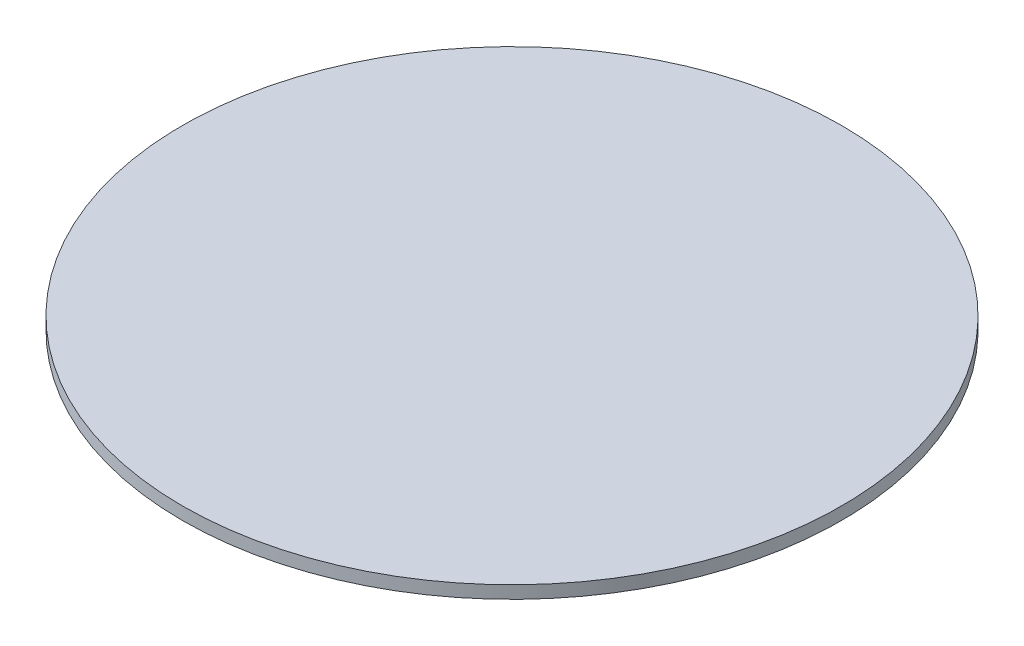
ISO-10303-21;
HEADER;
FILE_DESCRIPTION(('STEP AP214'),'2;1');
FILE_NAME('part.step','',(''),(''),'','','');
FILE_SCHEMA(('AUTOMOTIVE_DESIGN { 1 0 10303 214 1 1 1 1 }'));
ENDSEC;
DATA;
#1=APPLICATION_CONTEXT('core data for automotive mechanical design processes');
#2=APPLICATION_PROTOCOL_DEFINITION('international standard','automotive_design',2000,#1);
#3=PRODUCT_CONTEXT('',#1,'mechanical');
#4=PRODUCT('Part','Part','',(#3));
#5=PRODUCT_RELATED_PRODUCT_CATEGORY('part','',(#4));
#6=PRODUCT_DEFINITION_FORMATION('','',#4);
#7=PRODUCT_DEFINITION_CONTEXT('part definition',#1,'design');
#8=PRODUCT_DEFINITION('design','',#6,#7);
#9=PRODUCT_DEFINITION_SHAPE('','',#8);
#10=(LENGTH_UNIT() NAMED_UNIT(*) SI_UNIT(.MILLI.,.METRE.));
#11=(NAMED_UNIT(*) PLANE_ANGLE_UNIT() SI_UNIT($,.RADIAN.));
#12=(NAMED_UNIT(*) SI_UNIT($,.STERADIAN.) SOLID_ANGLE_UNIT());
#13=UNCERTAINTY_MEASURE_WITH_UNIT(LENGTH_MEASURE(1.E-05),#10,'distance_accuracy_value','');
#14=(GEOMETRIC_REPRESENTATION_CONTEXT(3) GLOBAL_UNCERTAINTY_ASSIGNED_CONTEXT((#13)) GLOBAL_UNIT_ASSIGNED_CONTEXT((#10,
#11,#12)) REPRESENTATION_CONTEXT('',''));
#15=CARTESIAN_POINT('',(0.,0.,0.));
#16=DIRECTION('',(0.,0.,1.));
#17=DIRECTION('',(1.,0.,0.));
#18=AXIS2_PLACEMENT_3D('',#15,#16,#17);
#19=CARTESIAN_POINT('',(0.,3.048,0.));
#20=DIRECTION('',(0.,-1.,0.));
#21=DIRECTION('',(0.,0.,-1.));
#22=AXIS2_PLACEMENT_3D('',#19,#20,#21);
#23=CYLINDRICAL_SURFACE('',#22,79.375);
#24=CARTESIAN_POINT('',(0.,3.048,0.));
#25=DIRECTION('',(0.,1.,0.));
#26=DIRECTION('',(0.,0.,1.));
#27=AXIS2_PLACEMENT_3D('',#24,#25,#26);
#28=CIRCLE('',#27,79.375);
#29=CARTESIAN_POINT('',(0.,3.048,79.375));
#30=VERTEX_POINT('',#29);
#31=EDGE_CURVE('E10',#30,#30,#28,.T.);
#32=ORIENTED_EDGE('',*,*,#31,.F.);
#33=EDGE_LOOP('',(#32));
#34=FACE_BOUND('',#33,.T.);
#35=CARTESIAN_POINT('',(0.,0.,0.));
#36=DIRECTION('',(0.,1.,0.));
#37=DIRECTION('',(0.,0.,1.));
#38=AXIS2_PLACEMENT_3D('',#35,#36,#37);
#39=CIRCLE('',#38,79.375);
#40=CARTESIAN_POINT('',(0.,0.,79.375));
#41=VERTEX_POINT('',#40);
#42=EDGE_CURVE('E33',#41,#41,#39,.T.);
#43=ORIENTED_EDGE('',*,*,#42,.T.);
#44=EDGE_LOOP('',(#43));
#45=FACE_BOUND('',#44,.T.);
#46=ADVANCED_FACE('F30',(#34,#45),#23,.T.);
#47=CARTESIAN_POINT('',(0.,3.048,0.));
#48=DIRECTION('',(0.,1.,0.));
#49=DIRECTION('',(0.,0.,1.));
#50=AXIS2_PLACEMENT_3D('',#47,#48,#49);
#51=PLANE('',#50);
#52=ORIENTED_EDGE('',*,*,#31,.T.);
#53=EDGE_LOOP('',(#52));
#54=FACE_BOUND('',#53,.T.);
#55=ADVANCED_FACE('F45',(#54),#51,.T.);
#56=CARTESIAN_POINT('',(0.,0.,0.));
#57=DIRECTION('',(0.,1.,0.));
#58=DIRECTION('',(0.,0.,1.));
#59=AXIS2_PLACEMENT_3D('',#56,#57,#58);
#60=PLANE('',#59);
#61=ORIENTED_EDGE('',*,*,#42,.F.);
#62=EDGE_LOOP('',(#61));
#63=FACE_BOUND('',#62,.T.);
#64=ADVANCED_FACE('F43',(#63),#60,.F.);
#65=CLOSED_SHELL('',(#46,#55,#64));
#66=MANIFOLD_SOLID_BREP('B2',#65);
#67=ADVANCED_BREP_SHAPE_REPRESENTATION('',(#18,#66),#14);
#68=SHAPE_DEFINITION_REPRESENTATION(#9,#67);
ENDSEC;
END-ISO-10303-21;
